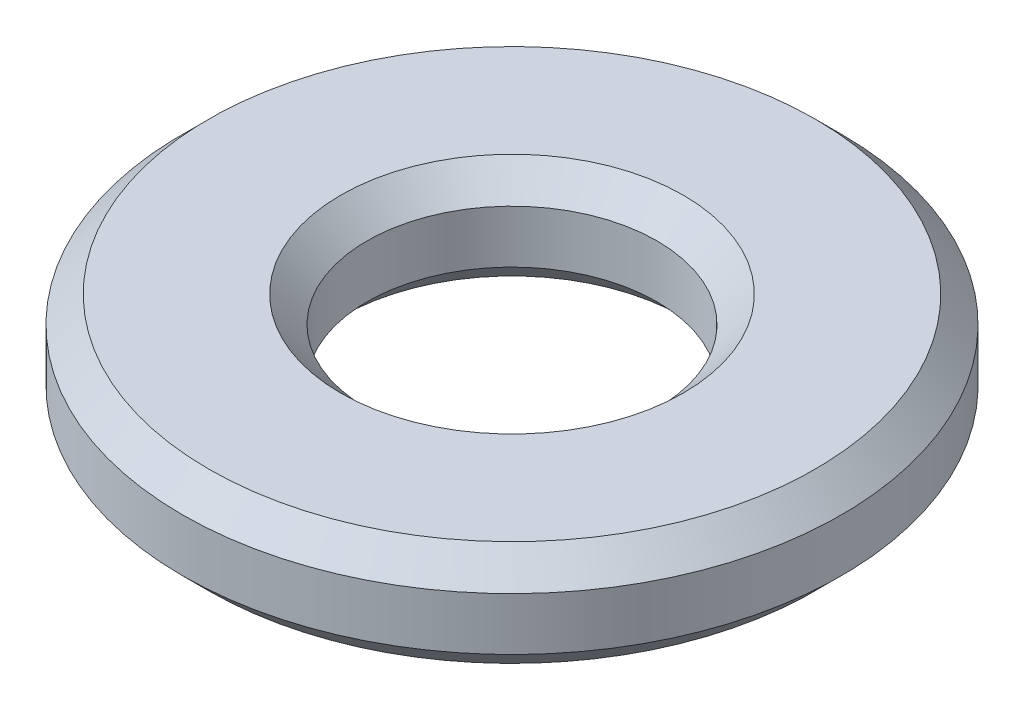
ISO-10303-21;
HEADER;
FILE_DESCRIPTION(('STEP AP214'),'2;1');
FILE_NAME('part.step','',(''),(''),'','','');
FILE_SCHEMA(('AUTOMOTIVE_DESIGN { 1 0 10303 214 1 1 1 1 }'));
ENDSEC;
DATA;
#1=APPLICATION_CONTEXT('core data for automotive mechanical design processes');
#2=APPLICATION_PROTOCOL_DEFINITION('international standard','automotive_design',2000,#1);
#3=PRODUCT_CONTEXT('',#1,'mechanical');
#4=PRODUCT('Part','Part','',(#3));
#5=PRODUCT_RELATED_PRODUCT_CATEGORY('part','',(#4));
#6=PRODUCT_DEFINITION_FORMATION('','',#4);
#7=PRODUCT_DEFINITION_CONTEXT('part definition',#1,'design');
#8=PRODUCT_DEFINITION('design','',#6,#7);
#9=PRODUCT_DEFINITION_SHAPE('','',#8);
#10=(LENGTH_UNIT() NAMED_UNIT(*) SI_UNIT(.MILLI.,.METRE.));
#11=(NAMED_UNIT(*) PLANE_ANGLE_UNIT() SI_UNIT($,.RADIAN.));
#12=(NAMED_UNIT(*) SI_UNIT($,.STERADIAN.) SOLID_ANGLE_UNIT());
#13=UNCERTAINTY_MEASURE_WITH_UNIT(LENGTH_MEASURE(1.E-05),#10,'distance_accuracy_value','');
#14=(GEOMETRIC_REPRESENTATION_CONTEXT(3) GLOBAL_UNCERTAINTY_ASSIGNED_CONTEXT((#13)) GLOBAL_UNIT_ASSIGNED_CONTEXT((#10,
#11,#12)) REPRESENTATION_CONTEXT('',''));
#15=CARTESIAN_POINT('',(0.,0.,0.));
#16=DIRECTION('',(0.,0.,1.));
#17=DIRECTION('',(1.,0.,0.));
#18=AXIS2_PLACEMENT_3D('',#15,#16,#17);
#19=CARTESIAN_POINT('',(0.,0.8,0.));
#20=DIRECTION('',(0.,1.,0.));
#21=DIRECTION('',(0.,0.,1.));
#22=AXIS2_PLACEMENT_3D('',#19,#20,#21);
#23=PLANE('',#22);
#24=CARTESIAN_POINT('',(0.,0.8,0.));
#25=DIRECTION('',(0.,1.,0.));
#26=DIRECTION('',(0.,0.,1.));
#27=AXIS2_PLACEMENT_3D('',#24,#25,#26);
#28=CIRCLE('',#27,1.3);
#29=CARTESIAN_POINT('',(0.,0.8,1.3));
#30=VERTEX_POINT('',#29);
#31=EDGE_CURVE('E10',#30,#30,#28,.F.);
#32=ORIENTED_EDGE('',*,*,#31,.T.);
#33=EDGE_LOOP('',(#32));
#34=FACE_BOUND('',#33,.T.);
#35=CARTESIAN_POINT('',(0.,0.8,0.));
#36=DIRECTION('',(0.,1.,0.));
#37=DIRECTION('',(0.,0.,1.));
#38=AXIS2_PLACEMENT_3D('',#35,#36,#37);
#39=CIRCLE('',#38,2.3);
#40=CARTESIAN_POINT('',(0.,0.8,2.3));
#41=VERTEX_POINT('',#40);
#42=EDGE_CURVE('E37',#41,#41,#39,.T.);
#43=ORIENTED_EDGE('',*,*,#42,.T.);
#44=EDGE_LOOP('',(#43));
#45=FACE_BOUND('',#44,.T.);
#46=ADVANCED_FACE('F30',(#34,#45),#23,.T.);
#47=CARTESIAN_POINT('',(0.,0.,0.));
#48=DIRECTION('',(0.,1.,0.));
#49=DIRECTION('',(0.,0.,1.));
#50=AXIS2_PLACEMENT_3D('',#47,#48,#49);
#51=PLANE('',#50);
#52=CARTESIAN_POINT('',(0.,0.,0.));
#53=DIRECTION('',(0.,1.,0.));
#54=DIRECTION('',(0.,0.,1.));
#55=AXIS2_PLACEMENT_3D('',#52,#53,#54);
#56=CIRCLE('',#55,1.3);
#57=CARTESIAN_POINT('',(0.,0.,1.3));
#58=VERTEX_POINT('',#57);
#59=EDGE_CURVE('E56',#58,#58,#56,.T.);
#60=ORIENTED_EDGE('',*,*,#59,.T.);
#61=EDGE_LOOP('',(#60));
#62=FACE_BOUND('',#61,.T.);
#63=CARTESIAN_POINT('',(0.,0.,0.));
#64=DIRECTION('',(0.,1.,0.));
#65=DIRECTION('',(0.,0.,1.));
#66=AXIS2_PLACEMENT_3D('',#63,#64,#65);
#67=CIRCLE('',#66,2.3);
#68=CARTESIAN_POINT('',(0.,0.,2.3));
#69=VERTEX_POINT('',#68);
#70=EDGE_CURVE('E59',#69,#69,#67,.F.);
#71=ORIENTED_EDGE('',*,*,#70,.T.);
#72=EDGE_LOOP('',(#71));
#73=FACE_BOUND('',#72,.T.);
#74=ADVANCED_FACE('F63',(#62,#73),#51,.F.);
#75=CARTESIAN_POINT('',(0.,0.8,0.));
#76=DIRECTION('',(0.,-1.,0.));
#77=DIRECTION('',(0.,0.,-1.));
#78=AXIS2_PLACEMENT_3D('',#75,#76,#77);
#79=CYLINDRICAL_SURFACE('',#78,2.5);
#80=CARTESIAN_POINT('',(0.,0.200000000000001,0.));
#81=DIRECTION('',(0.,1.,0.));
#82=DIRECTION('',(0.,0.,1.));
#83=AXIS2_PLACEMENT_3D('',#80,#81,#82);
#84=CIRCLE('',#83,2.5);
#85=CARTESIAN_POINT('',(0.,0.200000000000001,2.5));
#86=VERTEX_POINT('',#85);
#87=EDGE_CURVE('E41',#86,#86,#84,.T.);
#88=ORIENTED_EDGE('',*,*,#87,.T.);
#89=EDGE_LOOP('',(#88));
#90=FACE_BOUND('',#89,.T.);
#91=CARTESIAN_POINT('',(0.,0.599999999999999,0.));
#92=DIRECTION('',(0.,1.,0.));
#93=DIRECTION('',(0.,0.,1.));
#94=AXIS2_PLACEMENT_3D('',#91,#92,#93);
#95=CIRCLE('',#94,2.5);
#96=CARTESIAN_POINT('',(0.,0.599999999999999,2.5));
#97=VERTEX_POINT('',#96);
#98=EDGE_CURVE('E45',#97,#97,#95,.F.);
#99=ORIENTED_EDGE('',*,*,#98,.T.);
#100=EDGE_LOOP('',(#99));
#101=FACE_BOUND('',#100,.T.);
#102=ADVANCED_FACE('F73',(#90,#101),#79,.T.);
#103=CARTESIAN_POINT('',(0.,0.8,0.));
#104=DIRECTION('',(0.,-1.,0.));
#105=DIRECTION('',(0.,0.,-1.));
#106=AXIS2_PLACEMENT_3D('',#103,#104,#105);
#107=CYLINDRICAL_SURFACE('',#106,1.1);
#108=CARTESIAN_POINT('',(0.,0.2,0.));
#109=DIRECTION('',(0.,1.,0.));
#110=DIRECTION('',(0.,0.,1.));
#111=AXIS2_PLACEMENT_3D('',#108,#109,#110);
#112=CIRCLE('',#111,1.1);
#113=CARTESIAN_POINT('',(0.,0.2,1.1));
#114=VERTEX_POINT('',#113);
#115=EDGE_CURVE('E50',#114,#114,#112,.F.);
#116=ORIENTED_EDGE('',*,*,#115,.T.);
#117=EDGE_LOOP('',(#116));
#118=FACE_BOUND('',#117,.T.);
#119=CARTESIAN_POINT('',(0.,0.6,0.));
#120=DIRECTION('',(0.,1.,0.));
#121=DIRECTION('',(0.,0.,1.));
#122=AXIS2_PLACEMENT_3D('',#119,#120,#121);
#123=CIRCLE('',#122,1.1);
#124=CARTESIAN_POINT('',(0.,0.6,1.1));
#125=VERTEX_POINT('',#124);
#126=EDGE_CURVE('E53',#125,#125,#123,.T.);
#127=ORIENTED_EDGE('',*,*,#126,.T.);
#128=EDGE_LOOP('',(#127));
#129=FACE_BOUND('',#128,.T.);
#130=ADVANCED_FACE('F76',(#118,#129),#107,.F.);
#131=CARTESIAN_POINT('',(0.,0.,0.));
#132=DIRECTION('',(0.,-1.,0.));
#133=DIRECTION('',(0.,0.,-1.));
#134=AXIS2_PLACEMENT_3D('',#131,#132,#133);
#135=CONICAL_SURFACE('',#134,1.3,0.785398163397448);
#136=ORIENTED_EDGE('',*,*,#115,.F.);
#137=EDGE_LOOP('',(#136));
#138=FACE_BOUND('',#137,.T.);
#139=ORIENTED_EDGE('',*,*,#59,.F.);
#140=EDGE_LOOP('',(#139));
#141=FACE_BOUND('',#140,.T.);
#142=ADVANCED_FACE('F69',(#138,#141),#135,.F.);
#143=CARTESIAN_POINT('',(0.,0.200000000000001,0.));
#144=DIRECTION('',(0.,1.,0.));
#145=DIRECTION('',(0.,0.,1.));
#146=AXIS2_PLACEMENT_3D('',#143,#144,#145);
#147=CONICAL_SURFACE('',#146,2.5,0.78539816339745);
#148=ORIENTED_EDGE('',*,*,#70,.F.);
#149=EDGE_LOOP('',(#148));
#150=FACE_BOUND('',#149,.T.);
#151=ORIENTED_EDGE('',*,*,#87,.F.);
#152=EDGE_LOOP('',(#151));
#153=FACE_BOUND('',#152,.T.);
#154=ADVANCED_FACE('F65',(#150,#153),#147,.T.);
#155=CARTESIAN_POINT('',(0.,0.6,0.));
#156=DIRECTION('',(0.,1.,0.));
#157=DIRECTION('',(0.,0.,1.));
#158=AXIS2_PLACEMENT_3D('',#155,#156,#157);
#159=CONICAL_SURFACE('',#158,1.1,0.785398163397448);
#160=ORIENTED_EDGE('',*,*,#31,.F.);
#161=EDGE_LOOP('',(#160));
#162=FACE_BOUND('',#161,.T.);
#163=ORIENTED_EDGE('',*,*,#126,.F.);
#164=EDGE_LOOP('',(#163));
#165=FACE_BOUND('',#164,.T.);
#166=ADVANCED_FACE('F68',(#162,#165),#159,.F.);
#167=CARTESIAN_POINT('',(0.,0.8,0.));
#168=DIRECTION('',(0.,-1.,0.));
#169=DIRECTION('',(0.,0.,-1.));
#170=AXIS2_PLACEMENT_3D('',#167,#168,#169);
#171=CONICAL_SURFACE('',#170,2.3,0.785398163397447);
#172=ORIENTED_EDGE('',*,*,#98,.F.);
#173=EDGE_LOOP('',(#172));
#174=FACE_BOUND('',#173,.T.);
#175=ORIENTED_EDGE('',*,*,#42,.F.);
#176=EDGE_LOOP('',(#175));
#177=FACE_BOUND('',#176,.T.);
#178=ADVANCED_FACE('F32',(#174,#177),#171,.T.);
#179=CLOSED_SHELL('',(#46,#74,#102,#130,#142,#154,#166,#178));
#180=MANIFOLD_SOLID_BREP('B2',#179);
#181=ADVANCED_BREP_SHAPE_REPRESENTATION('',(#18,#180),#14);
#182=SHAPE_DEFINITION_REPRESENTATION(#9,#181);
ENDSEC;
END-ISO-10303-21;
